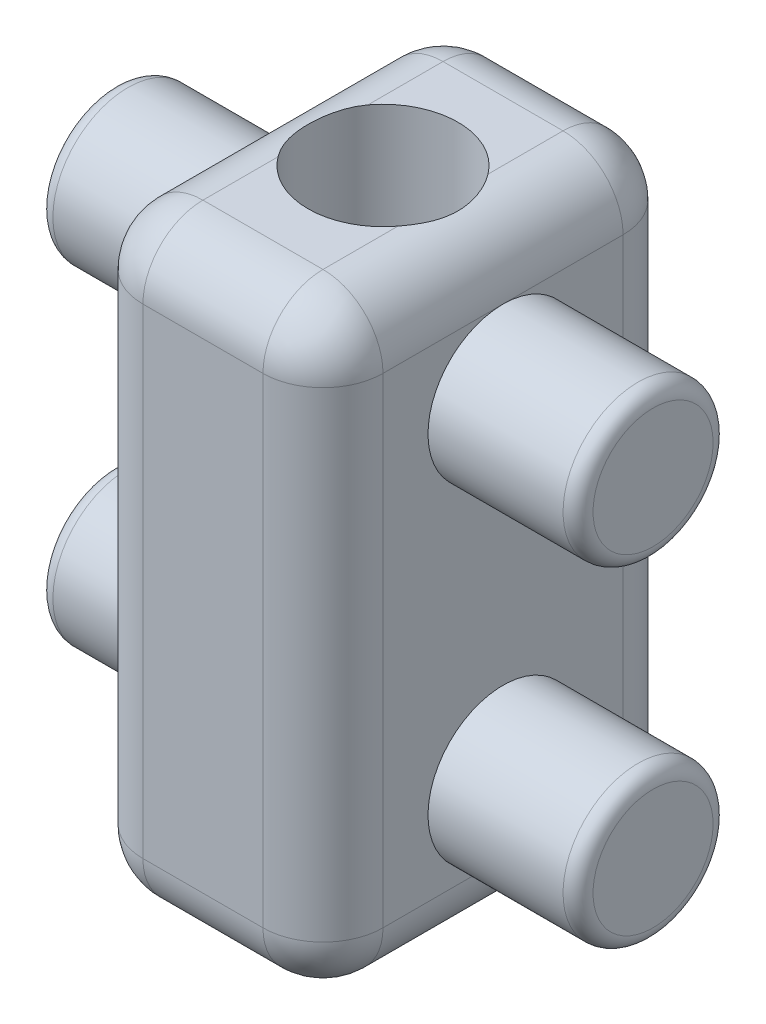
ISO-10303-21;
HEADER;
FILE_DESCRIPTION(('STEP AP214'),'2;1');
FILE_NAME('part.step','',(''),(''),'','','');
FILE_SCHEMA(('AUTOMOTIVE_DESIGN { 1 0 10303 214 1 1 1 1 }'));
ENDSEC;
DATA;
#1=APPLICATION_CONTEXT('core data for automotive mechanical design processes');
#2=APPLICATION_PROTOCOL_DEFINITION('international standard','automotive_design',2000,#1);
#3=PRODUCT_CONTEXT('',#1,'mechanical');
#4=PRODUCT('Part','Part','',(#3));
#5=PRODUCT_RELATED_PRODUCT_CATEGORY('part','',(#4));
#6=PRODUCT_DEFINITION_FORMATION('','',#4);
#7=PRODUCT_DEFINITION_CONTEXT('part definition',#1,'design');
#8=PRODUCT_DEFINITION('design','',#6,#7);
#9=PRODUCT_DEFINITION_SHAPE('','',#8);
#10=(LENGTH_UNIT() NAMED_UNIT(*) SI_UNIT(.MILLI.,.METRE.));
#11=(NAMED_UNIT(*) PLANE_ANGLE_UNIT() SI_UNIT($,.RADIAN.));
#12=(NAMED_UNIT(*) SI_UNIT($,.STERADIAN.) SOLID_ANGLE_UNIT());
#13=UNCERTAINTY_MEASURE_WITH_UNIT(LENGTH_MEASURE(1.E-05),#10,'distance_accuracy_value','');
#14=(GEOMETRIC_REPRESENTATION_CONTEXT(3) GLOBAL_UNCERTAINTY_ASSIGNED_CONTEXT((#13)) GLOBAL_UNIT_ASSIGNED_CONTEXT((#10,
#11,#12)) REPRESENTATION_CONTEXT('',''));
#15=CARTESIAN_POINT('',(0.,0.,0.));
#16=DIRECTION('',(0.,0.,1.));
#17=DIRECTION('',(1.,0.,0.));
#18=AXIS2_PLACEMENT_3D('',#15,#16,#17);
#19=CARTESIAN_POINT('',(-11.43,12.7,-12.7));
#20=DIRECTION('',(0.,-1.,0.));
#21=DIRECTION('',(0.,0.,-1.));
#22=AXIS2_PLACEMENT_3D('',#19,#20,#21);
#23=PLANE('',#22);
#24=DIRECTION('',(0.,0.,1.));
#25=VECTOR('',#24,1.);
#26=CARTESIAN_POINT('',(2.54,12.7,7.62));
#27=LINE('',#26,#25);
#28=CARTESIAN_POINT('',(2.54,12.7,5.08));
#29=VERTEX_POINT('',#28);
#30=CARTESIAN_POINT('',(2.54,12.7,1.905));
#31=VERTEX_POINT('',#30);
#32=EDGE_CURVE('E157',#29,#31,#27,.F.);
#33=ORIENTED_EDGE('',*,*,#32,.T.);
#34=CARTESIAN_POINT('',(0.,12.7,0.));
#35=DIRECTION('',(0.,-1.,0.));
#36=DIRECTION('',(0.,0.,-1.));
#37=AXIS2_PLACEMENT_3D('',#34,#35,#36);
#38=CIRCLE('',#37,3.175);
#39=CARTESIAN_POINT('',(-2.54,12.7,1.905));
#40=VERTEX_POINT('',#39);
#41=EDGE_CURVE('E11',#31,#40,#38,.T.);
#42=ORIENTED_EDGE('',*,*,#41,.T.);
#43=DIRECTION('',(0.,0.,1.));
#44=VECTOR('',#43,1.);
#45=CARTESIAN_POINT('',(-2.54,12.7,7.62));
#46=LINE('',#45,#44);
#47=CARTESIAN_POINT('',(-2.54,12.7,5.08));
#48=VERTEX_POINT('',#47);
#49=EDGE_CURVE('E173',#40,#48,#46,.T.);
#50=ORIENTED_EDGE('',*,*,#49,.T.);
#51=DIRECTION('',(-1.,0.,0.));
#52=VECTOR('',#51,1.);
#53=CARTESIAN_POINT('',(5.08,12.7,5.08));
#54=LINE('',#53,#52);
#55=EDGE_CURVE('E163',#48,#29,#54,.F.);
#56=ORIENTED_EDGE('',*,*,#55,.T.);
#57=EDGE_LOOP('',(#33,#42,#50,#56));
#58=FACE_BOUND('',#57,.T.);
#59=ADVANCED_FACE('F35',(#58),#23,.F.);
#60=CARTESIAN_POINT('',(5.08,0.,0.));
#61=DIRECTION('',(-1.,0.,0.));
#62=DIRECTION('',(0.,0.,1.));
#63=AXIS2_PLACEMENT_3D('',#60,#61,#62);
#64=PLANE('',#63);
#65=DIRECTION('',(0.,0.,-1.));
#66=VECTOR('',#65,1.);
#67=CARTESIAN_POINT('',(5.08,-10.16,0.));
#68=LINE('',#67,#66);
#69=CARTESIAN_POINT('',(5.08,-10.16,5.08));
#70=VERTEX_POINT('',#69);
#71=CARTESIAN_POINT('',(5.08,-10.16,0.));
#72=VERTEX_POINT('',#71);
#73=EDGE_CURVE('E203',#70,#72,#68,.T.);
#74=ORIENTED_EDGE('',*,*,#73,.T.);
#75=CARTESIAN_POINT('',(5.08,-6.985,0.));
#76=DIRECTION('',(1.,0.,0.));
#77=DIRECTION('',(0.,0.,-1.));
#78=AXIS2_PLACEMENT_3D('',#75,#76,#77);
#79=CIRCLE('',#78,3.175);
#80=EDGE_CURVE('E705',#72,#72,#79,.T.);
#81=ORIENTED_EDGE('',*,*,#80,.F.);
#82=CARTESIAN_POINT('',(5.08,-10.16,-5.08));
#83=VERTEX_POINT('',#82);
#84=EDGE_CURVE('E202',#72,#83,#68,.T.);
#85=ORIENTED_EDGE('',*,*,#84,.T.);
#86=DIRECTION('',(0.,1.,0.));
#87=VECTOR('',#86,1.);
#88=CARTESIAN_POINT('',(5.08,0.,-5.08));
#89=LINE('',#88,#87);
#90=CARTESIAN_POINT('',(5.08,10.16,-5.08));
#91=VERTEX_POINT('',#90);
#92=EDGE_CURVE('E196',#83,#91,#89,.T.);
#93=ORIENTED_EDGE('',*,*,#92,.T.);
#94=DIRECTION('',(0.,0.,1.));
#95=VECTOR('',#94,1.);
#96=CARTESIAN_POINT('',(5.08,10.16,0.));
#97=LINE('',#96,#95);
#98=CARTESIAN_POINT('',(5.08,10.16,0.));
#99=VERTEX_POINT('',#98);
#100=EDGE_CURVE('E199',#91,#99,#97,.T.);
#101=ORIENTED_EDGE('',*,*,#100,.T.);
#102=CARTESIAN_POINT('',(5.08,6.985,0.));
#103=DIRECTION('',(1.,0.,0.));
#104=DIRECTION('',(0.,0.,-1.));
#105=AXIS2_PLACEMENT_3D('',#102,#103,#104);
#106=CIRCLE('',#105,3.175);
#107=EDGE_CURVE('E209',#99,#99,#106,.T.);
#108=ORIENTED_EDGE('',*,*,#107,.F.);
#109=CARTESIAN_POINT('',(5.08,10.16,5.08));
#110=VERTEX_POINT('',#109);
#111=EDGE_CURVE('E198',#99,#110,#97,.T.);
#112=ORIENTED_EDGE('',*,*,#111,.T.);
#113=DIRECTION('',(0.,-1.,0.));
#114=VECTOR('',#113,1.);
#115=CARTESIAN_POINT('',(5.08,0.,5.08));
#116=LINE('',#115,#114);
#117=EDGE_CURVE('E58',#110,#70,#116,.T.);
#118=ORIENTED_EDGE('',*,*,#117,.T.);
#119=EDGE_LOOP('',(#74,#81,#85,#93,#101,#108,#112,#118));
#120=FACE_BOUND('',#119,.T.);
#121=ADVANCED_FACE('F365',(#120),#64,.F.);
#122=CARTESIAN_POINT('',(5.08,-12.7,-7.62));
#123=DIRECTION('',(0.,0.,1.));
#124=DIRECTION('',(1.,0.,0.));
#125=AXIS2_PLACEMENT_3D('',#122,#123,#124);
#126=PLANE('',#125);
#127=DIRECTION('',(-1.,0.,0.));
#128=VECTOR('',#127,1.);
#129=CARTESIAN_POINT('',(5.08,-10.16,-7.62));
#130=LINE('',#129,#128);
#131=CARTESIAN_POINT('',(2.54,-10.16,-7.62));
#132=VERTEX_POINT('',#131);
#133=CARTESIAN_POINT('',(-2.54,-10.16,-7.62));
#134=VERTEX_POINT('',#133);
#135=EDGE_CURVE('E715',#132,#134,#130,.T.);
#136=ORIENTED_EDGE('',*,*,#135,.T.);
#137=DIRECTION('',(0.,1.,0.));
#138=VECTOR('',#137,1.);
#139=CARTESIAN_POINT('',(-2.54,12.7,-7.62));
#140=LINE('',#139,#138);
#141=CARTESIAN_POINT('',(-2.54,10.16,-7.62));
#142=VERTEX_POINT('',#141);
#143=EDGE_CURVE('E718',#134,#142,#140,.T.);
#144=ORIENTED_EDGE('',*,*,#143,.T.);
#145=DIRECTION('',(-1.,0.,0.));
#146=VECTOR('',#145,1.);
#147=CARTESIAN_POINT('',(5.08,10.16,-7.62));
#148=LINE('',#147,#146);
#149=CARTESIAN_POINT('',(2.54,10.16,-7.62));
#150=VERTEX_POINT('',#149);
#151=EDGE_CURVE('E713',#142,#150,#148,.F.);
#152=ORIENTED_EDGE('',*,*,#151,.T.);
#153=DIRECTION('',(0.,1.,0.));
#154=VECTOR('',#153,1.);
#155=CARTESIAN_POINT('',(2.54,-12.7,-7.62));
#156=LINE('',#155,#154);
#157=EDGE_CURVE('E276',#150,#132,#156,.F.);
#158=ORIENTED_EDGE('',*,*,#157,.T.);
#159=EDGE_LOOP('',(#136,#144,#152,#158));
#160=FACE_BOUND('',#159,.T.);
#161=ADVANCED_FACE('F368',(#160),#126,.F.);
#162=CARTESIAN_POINT('',(5.08,-12.7,7.62));
#163=DIRECTION('',(0.,0.,-1.));
#164=DIRECTION('',(-1.,0.,0.));
#165=AXIS2_PLACEMENT_3D('',#162,#163,#164);
#166=PLANE('',#165);
#167=DIRECTION('',(-1.,0.,0.));
#168=VECTOR('',#167,1.);
#169=CARTESIAN_POINT('',(5.08,10.16,7.62));
#170=LINE('',#169,#168);
#171=CARTESIAN_POINT('',(2.54,10.16,7.62));
#172=VERTEX_POINT('',#171);
#173=CARTESIAN_POINT('',(-2.54,10.16,7.62));
#174=VERTEX_POINT('',#173);
#175=EDGE_CURVE('E181',#172,#174,#170,.T.);
#176=ORIENTED_EDGE('',*,*,#175,.T.);
#177=DIRECTION('',(0.,-1.,0.));
#178=VECTOR('',#177,1.);
#179=CARTESIAN_POINT('',(-2.54,-12.7,7.62));
#180=LINE('',#179,#178);
#181=CARTESIAN_POINT('',(-2.54,-10.16,7.62));
#182=VERTEX_POINT('',#181);
#183=EDGE_CURVE('E184',#174,#182,#180,.T.);
#184=ORIENTED_EDGE('',*,*,#183,.T.);
#185=DIRECTION('',(-1.,0.,0.));
#186=VECTOR('',#185,1.);
#187=CARTESIAN_POINT('',(5.08,-10.16,7.62));
#188=LINE('',#187,#186);
#189=CARTESIAN_POINT('',(2.54,-10.16,7.62));
#190=VERTEX_POINT('',#189);
#191=EDGE_CURVE('E179',#182,#190,#188,.F.);
#192=ORIENTED_EDGE('',*,*,#191,.T.);
#193=DIRECTION('',(0.,-1.,0.));
#194=VECTOR('',#193,1.);
#195=CARTESIAN_POINT('',(2.54,-12.7,7.62));
#196=LINE('',#195,#194);
#197=EDGE_CURVE('E177',#190,#172,#196,.F.);
#198=ORIENTED_EDGE('',*,*,#197,.T.);
#199=EDGE_LOOP('',(#176,#184,#192,#198));
#200=FACE_BOUND('',#199,.T.);
#201=ADVANCED_FACE('F377',(#200),#166,.F.);
#202=CARTESIAN_POINT('',(5.08,-12.7,7.62));
#203=DIRECTION('',(0.,1.,0.));
#204=DIRECTION('',(0.,0.,1.));
#205=AXIS2_PLACEMENT_3D('',#202,#203,#204);
#206=PLANE('',#205);
#207=DIRECTION('',(-1.,0.,0.));
#208=VECTOR('',#207,1.);
#209=CARTESIAN_POINT('',(5.08,-12.7,5.08));
#210=LINE('',#209,#208);
#211=CARTESIAN_POINT('',(2.54,-12.7,5.08));
#212=VERTEX_POINT('',#211);
#213=CARTESIAN_POINT('',(-2.54,-12.7,5.08));
#214=VERTEX_POINT('',#213);
#215=EDGE_CURVE('E722',#212,#214,#210,.T.);
#216=ORIENTED_EDGE('',*,*,#215,.T.);
#217=DIRECTION('',(0.,0.,-1.));
#218=VECTOR('',#217,1.);
#219=CARTESIAN_POINT('',(-2.54,-12.7,-7.62));
#220=LINE('',#219,#218);
#221=CARTESIAN_POINT('',(-2.54,-12.7,-5.08));
#222=VERTEX_POINT('',#221);
#223=EDGE_CURVE('E168',#214,#222,#220,.T.);
#224=ORIENTED_EDGE('',*,*,#223,.T.);
#225=DIRECTION('',(-1.,0.,0.));
#226=VECTOR('',#225,1.);
#227=CARTESIAN_POINT('',(5.08,-12.7,-5.08));
#228=LINE('',#227,#226);
#229=CARTESIAN_POINT('',(2.54,-12.7,-5.08));
#230=VERTEX_POINT('',#229);
#231=EDGE_CURVE('E723',#222,#230,#228,.F.);
#232=ORIENTED_EDGE('',*,*,#231,.T.);
#233=DIRECTION('',(0.,0.,-1.));
#234=VECTOR('',#233,1.);
#235=CARTESIAN_POINT('',(2.54,-12.7,7.62));
#236=LINE('',#235,#234);
#237=EDGE_CURVE('E720',#230,#212,#236,.F.);
#238=ORIENTED_EDGE('',*,*,#237,.T.);
#239=EDGE_LOOP('',(#216,#224,#232,#238));
#240=FACE_BOUND('',#239,.T.);
#241=ADVANCED_FACE('F373',(#240),#206,.F.);
#242=CARTESIAN_POINT('',(-5.08,0.,0.));
#243=DIRECTION('',(-1.,0.,0.));
#244=DIRECTION('',(0.,0.,1.));
#245=AXIS2_PLACEMENT_3D('',#242,#243,#244);
#246=PLANE('',#245);
#247=DIRECTION('',(0.,0.,-1.));
#248=VECTOR('',#247,1.);
#249=CARTESIAN_POINT('',(-5.08,-10.16,7.62));
#250=LINE('',#249,#248);
#251=CARTESIAN_POINT('',(-5.08,-10.16,-5.08));
#252=VERTEX_POINT('',#251);
#253=CARTESIAN_POINT('',(-5.08,-10.16,0.));
#254=VERTEX_POINT('',#253);
#255=EDGE_CURVE('E189',#252,#254,#250,.F.);
#256=ORIENTED_EDGE('',*,*,#255,.T.);
#257=CARTESIAN_POINT('',(-5.08,-6.985,0.));
#258=DIRECTION('',(1.,0.,0.));
#259=DIRECTION('',(0.,0.,-1.));
#260=AXIS2_PLACEMENT_3D('',#257,#258,#259);
#261=CIRCLE('',#260,3.175);
#262=EDGE_CURVE('E160',#254,#254,#261,.T.);
#263=ORIENTED_EDGE('',*,*,#262,.T.);
#264=CARTESIAN_POINT('',(-5.08,-10.16,5.08));
#265=VERTEX_POINT('',#264);
#266=EDGE_CURVE('E188',#254,#265,#250,.F.);
#267=ORIENTED_EDGE('',*,*,#266,.T.);
#268=DIRECTION('',(0.,-1.,0.));
#269=VECTOR('',#268,1.);
#270=CARTESIAN_POINT('',(-5.08,12.7,5.08));
#271=LINE('',#270,#269);
#272=CARTESIAN_POINT('',(-5.08,10.16,5.08));
#273=VERTEX_POINT('',#272);
#274=EDGE_CURVE('E191',#265,#273,#271,.F.);
#275=ORIENTED_EDGE('',*,*,#274,.T.);
#276=DIRECTION('',(0.,0.,1.));
#277=VECTOR('',#276,1.);
#278=CARTESIAN_POINT('',(-5.08,10.16,-7.62));
#279=LINE('',#278,#277);
#280=CARTESIAN_POINT('',(-5.08,10.16,0.));
#281=VERTEX_POINT('',#280);
#282=EDGE_CURVE('E194',#273,#281,#279,.F.);
#283=ORIENTED_EDGE('',*,*,#282,.T.);
#284=CARTESIAN_POINT('',(-5.08,6.985,0.));
#285=DIRECTION('',(1.,0.,0.));
#286=DIRECTION('',(0.,0.,-1.));
#287=AXIS2_PLACEMENT_3D('',#284,#285,#286);
#288=CIRCLE('',#287,3.175);
#289=EDGE_CURVE('E708',#281,#281,#288,.T.);
#290=ORIENTED_EDGE('',*,*,#289,.T.);
#291=CARTESIAN_POINT('',(-5.08,10.16,-5.08));
#292=VERTEX_POINT('',#291);
#293=EDGE_CURVE('E193',#281,#292,#279,.F.);
#294=ORIENTED_EDGE('',*,*,#293,.T.);
#295=DIRECTION('',(0.,1.,0.));
#296=VECTOR('',#295,1.);
#297=CARTESIAN_POINT('',(-5.08,-12.7,-5.08));
#298=LINE('',#297,#296);
#299=EDGE_CURVE('E186',#292,#252,#298,.F.);
#300=ORIENTED_EDGE('',*,*,#299,.T.);
#301=EDGE_LOOP('',(#256,#263,#267,#275,#283,#290,#294,#300));
#302=FACE_BOUND('',#301,.T.);
#303=ADVANCED_FACE('F369',(#302),#246,.T.);
#304=CARTESIAN_POINT('',(5.08,10.16,5.08));
#305=DIRECTION('',(-1.,0.,0.));
#306=DIRECTION('',(0.,0.,1.));
#307=AXIS2_PLACEMENT_3D('',#304,#305,#306);
#308=CYLINDRICAL_SURFACE('',#307,2.54);
#309=CARTESIAN_POINT('',(2.54,10.16,5.08));
#310=DIRECTION('',(1.,0.,0.));
#311=DIRECTION('',(0.,0.,-1.));
#312=AXIS2_PLACEMENT_3D('',#309,#310,#311);
#313=CIRCLE('',#312,2.54);
#314=EDGE_CURVE('E273',#29,#172,#313,.T.);
#315=ORIENTED_EDGE('',*,*,#314,.F.);
#316=ORIENTED_EDGE('',*,*,#55,.F.);
#317=CARTESIAN_POINT('',(-2.54,10.16,5.08));
#318=DIRECTION('',(-1.,0.,0.));
#319=DIRECTION('',(0.,0.,1.));
#320=AXIS2_PLACEMENT_3D('',#317,#318,#319);
#321=CIRCLE('',#320,2.54);
#322=EDGE_CURVE('E270',#174,#48,#321,.T.);
#323=ORIENTED_EDGE('',*,*,#322,.F.);
#324=ORIENTED_EDGE('',*,*,#175,.F.);
#325=EDGE_LOOP('',(#315,#316,#323,#324));
#326=FACE_BOUND('',#325,.T.);
#327=ADVANCED_FACE('F372',(#326),#308,.T.);
#328=CARTESIAN_POINT('',(2.54,10.16,5.08));
#329=DIRECTION('',(0.,0.,1.));
#330=DIRECTION('',(1.,0.,0.));
#331=AXIS2_PLACEMENT_3D('',#328,#329,#330);
#332=SPHERICAL_SURFACE('',#331,2.54);
#333=CARTESIAN_POINT('',(2.54,10.16,5.08));
#334=DIRECTION('',(0.,0.,1.));
#335=DIRECTION('',(1.,0.,0.));
#336=AXIS2_PLACEMENT_3D('',#333,#334,#335);
#337=CIRCLE('',#336,2.54);
#338=EDGE_CURVE('E265',#29,#110,#337,.F.);
#339=ORIENTED_EDGE('',*,*,#338,.F.);
#340=ORIENTED_EDGE('',*,*,#314,.T.);
#341=CARTESIAN_POINT('',(2.54,10.16,5.08));
#342=DIRECTION('',(0.,1.,0.));
#343=DIRECTION('',(0.,0.,1.));
#344=AXIS2_PLACEMENT_3D('',#341,#342,#343);
#345=CIRCLE('',#344,2.54);
#346=EDGE_CURVE('E267',#110,#172,#345,.F.);
#347=ORIENTED_EDGE('',*,*,#346,.F.);
#348=EDGE_LOOP('',(#339,#340,#347));
#349=FACE_BOUND('',#348,.T.);
#350=ADVANCED_FACE('F648',(#349),#332,.T.);
#351=CARTESIAN_POINT('',(-2.54,10.16,5.08));
#352=DIRECTION('',(0.,0.,1.));
#353=DIRECTION('',(1.,0.,0.));
#354=AXIS2_PLACEMENT_3D('',#351,#352,#353);
#355=SPHERICAL_SURFACE('',#354,2.54);
#356=CARTESIAN_POINT('',(-2.54,10.16,5.08));
#357=DIRECTION('',(0.,1.,0.));
#358=DIRECTION('',(0.,0.,1.));
#359=AXIS2_PLACEMENT_3D('',#356,#357,#358);
#360=CIRCLE('',#359,2.54);
#361=EDGE_CURVE('E259',#174,#273,#360,.F.);
#362=ORIENTED_EDGE('',*,*,#361,.F.);
#363=ORIENTED_EDGE('',*,*,#322,.T.);
#364=CARTESIAN_POINT('',(-2.54,10.16,5.08));
#365=DIRECTION('',(0.,0.,1.));
#366=DIRECTION('',(1.,0.,0.));
#367=AXIS2_PLACEMENT_3D('',#364,#365,#366);
#368=CIRCLE('',#367,2.54);
#369=EDGE_CURVE('E262',#273,#48,#368,.F.);
#370=ORIENTED_EDGE('',*,*,#369,.F.);
#371=EDGE_LOOP('',(#362,#363,#370));
#372=FACE_BOUND('',#371,.T.);
#373=ADVANCED_FACE('F638',(#372),#355,.T.);
#374=CARTESIAN_POINT('',(2.54,0.,5.08));
#375=DIRECTION('',(0.,-1.,0.));
#376=DIRECTION('',(0.,0.,-1.));
#377=AXIS2_PLACEMENT_3D('',#374,#375,#376);
#378=CYLINDRICAL_SURFACE('',#377,2.54);
#379=ORIENTED_EDGE('',*,*,#346,.T.);
#380=ORIENTED_EDGE('',*,*,#197,.F.);
#381=CARTESIAN_POINT('',(2.54,-10.16,5.08));
#382=DIRECTION('',(0.,-1.,0.));
#383=DIRECTION('',(0.,0.,-1.));
#384=AXIS2_PLACEMENT_3D('',#381,#382,#383);
#385=CIRCLE('',#384,2.54);
#386=EDGE_CURVE('E253',#70,#190,#385,.T.);
#387=ORIENTED_EDGE('',*,*,#386,.F.);
#388=ORIENTED_EDGE('',*,*,#117,.F.);
#389=EDGE_LOOP('',(#379,#380,#387,#388));
#390=FACE_BOUND('',#389,.T.);
#391=ADVANCED_FACE('F632',(#390),#378,.T.);
#392=CARTESIAN_POINT('',(2.54,10.16,0.));
#393=DIRECTION('',(0.,0.,1.));
#394=DIRECTION('',(1.,0.,0.));
#395=AXIS2_PLACEMENT_3D('',#392,#393,#394);
#396=CYLINDRICAL_SURFACE('',#395,2.54);
#397=CARTESIAN_POINT('',(2.54,12.7,1.905));
#398=CARTESIAN_POINT('',(2.5930144747761,12.6999862252163,1.83433008024039));
#399=CARTESIAN_POINT('',(2.64304418780027,12.6983400949674,1.76146316158012));
#400=CARTESIAN_POINT('',(2.73681256754995,12.6928023717573,1.61190923242004));
#401=CARTESIAN_POINT('',(2.78055403974719,12.6889117840593,1.5352239461572));
#402=CARTESIAN_POINT('',(2.86150406932594,12.6798990340502,1.37848165114559));
#403=CARTESIAN_POINT('',(2.89870748689939,12.6747759102249,1.29842205047689));
#404=CARTESIAN_POINT('',(2.96631988606513,12.6642012790137,1.13549535037719));
#405=CARTESIAN_POINT('',(2.99672819686997,12.6587497392752,1.05262797470223));
#406=CARTESIAN_POINT('',(3.05054069604224,12.6483126113036,0.88464818978456));
#407=CARTESIAN_POINT('',(3.0739470624711,12.6433268785069,0.799536487656744));
#408=CARTESIAN_POINT('',(3.1136022125579,12.6344684587865,0.627605400580466));
#409=CARTESIAN_POINT('',(3.12985126443965,12.6305957301544,0.540786079753235));
#410=CARTESIAN_POINT('',(3.15504934782979,12.624443734051,0.366145178129403));
#411=CARTESIAN_POINT('',(3.16400731259552,12.6221625171033,0.278324957914515));
#412=CARTESIAN_POINT('',(3.17458002225839,12.6194589557401,0.102214919682188));
#413=CARTESIAN_POINT('',(3.17619487430703,12.6190365842002,0.0139251085358922));
#414=CARTESIAN_POINT('',(3.17208089299991,12.6200971385345,-0.161895069374409));
#415=CARTESIAN_POINT('',(3.16639983447211,12.6215676695157,-0.249426636477158));
#416=CARTESIAN_POINT('',(3.14782483185976,12.6262198130967,-0.423675780026822));
#417=CARTESIAN_POINT('',(3.13493069870951,12.6294014705478,-0.510393335076655));
#418=CARTESIAN_POINT('',(3.10201816982114,12.6370992435227,-0.682489232509958));
#419=CARTESIAN_POINT('',(3.08199288994507,12.6416166478083,-0.767866197293173));
#420=CARTESIAN_POINT('',(3.03496640143451,12.6514222048976,-0.936630510721468));
#421=CARTESIAN_POINT('',(3.00796532716197,12.6567103428551,-1.02001789765435));
#422=CARTESIAN_POINT('',(2.95102683913863,12.6666673723006,-1.17384523842122));
#423=CARTESIAN_POINT('',(2.92189644299456,12.6713297189628,-1.24458573482167));
#424=CARTESIAN_POINT('',(2.85859769024736,12.68014203093,-1.3837954353501));
#425=CARTESIAN_POINT('',(2.82443031366766,12.6842920956194,-1.45226507814085));
#426=CARTESIAN_POINT('',(2.75126299343156,12.6914658240478,-1.58650838612093));
#427=CARTESIAN_POINT('',(2.71227019344552,12.6944911269402,-1.65228584922509));
#428=CARTESIAN_POINT('',(2.62959767281221,12.6987548964392,-1.78092659831066));
#429=CARTESIAN_POINT('',(2.5859157945231,12.6999925366479,-1.84378852351398));
#430=CARTESIAN_POINT('',(2.54,12.7,-1.905));
#431=B_SPLINE_CURVE_WITH_KNOTS('',3,(#397,#398,#399,#400,#401,#402,#403,#404,#405,#406,#407,
#408,#409,#410,#411,#412,#413,#414,#415,#416,#417,#418,#419,#420,#421,#422,#423,#424,#425,#426,
#427,#428,#429,#430),.UNSPECIFIED.,.F.,.F.,(4,2,2,2,2,2,2,2,2,2,2,2,2,2,2,2,4),(0.,
0.26489527949035,0.529672007856606,0.794655964885841,1.05966606859315,1.32459365094662,
1.58951130416678,1.85410388168812,2.1186925982337,2.38155754601834,2.64442938421755,
2.90755567990787,3.17067690785609,3.40041930587477,3.63011706276295,3.85947874883193,
4.08894642994839),.UNSPECIFIED.);
#432=CARTESIAN_POINT('',(2.54,12.7,-1.905));
#433=VERTEX_POINT('',#432);
#434=EDGE_CURVE('E50',#31,#433,#431,.T.);
#435=ORIENTED_EDGE('',*,*,#434,.F.);
#436=ORIENTED_EDGE('',*,*,#32,.F.);
#437=ORIENTED_EDGE('',*,*,#338,.T.);
#438=ORIENTED_EDGE('',*,*,#111,.F.);
#439=ORIENTED_EDGE('',*,*,#100,.F.);
#440=CARTESIAN_POINT('',(2.54,10.16,-5.08));
#441=DIRECTION('',(0.,0.,-1.));
#442=DIRECTION('',(-1.,0.,0.));
#443=AXIS2_PLACEMENT_3D('',#440,#441,#442);
#444=CIRCLE('',#443,2.54);
#445=CARTESIAN_POINT('',(2.54,12.7,-5.08));
#446=VERTEX_POINT('',#445);
#447=EDGE_CURVE('E250',#446,#91,#444,.T.);
#448=ORIENTED_EDGE('',*,*,#447,.F.);
#449=EDGE_CURVE('E159',#433,#446,#27,.F.);
#450=ORIENTED_EDGE('',*,*,#449,.F.);
#451=EDGE_LOOP('',(#435,#436,#437,#438,#439,#448,#450));
#452=FACE_BOUND('',#451,.T.);
#453=ADVANCED_FACE('F155',(#452),#396,.T.);
#454=CARTESIAN_POINT('',(5.08,10.16,-5.08));
#455=DIRECTION('',(-1.,0.,0.));
#456=DIRECTION('',(0.,0.,1.));
#457=AXIS2_PLACEMENT_3D('',#454,#455,#456);
#458=CYLINDRICAL_SURFACE('',#457,2.54);
#459=CARTESIAN_POINT('',(-2.54,10.16,-5.08));
#460=DIRECTION('',(-1.,0.,0.));
#461=DIRECTION('',(0.,0.,1.));
#462=AXIS2_PLACEMENT_3D('',#459,#460,#461);
#463=CIRCLE('',#462,2.54);
#464=CARTESIAN_POINT('',(-2.54,12.7,-5.08));
#465=VERTEX_POINT('',#464);
#466=EDGE_CURVE('E244',#465,#142,#463,.T.);
#467=ORIENTED_EDGE('',*,*,#466,.F.);
#468=DIRECTION('',(-1.,0.,0.));
#469=VECTOR('',#468,1.);
#470=CARTESIAN_POINT('',(5.08,12.7,-5.08));
#471=LINE('',#470,#469);
#472=EDGE_CURVE('E166',#446,#465,#471,.T.);
#473=ORIENTED_EDGE('',*,*,#472,.F.);
#474=CARTESIAN_POINT('',(2.54,10.16,-5.08));
#475=DIRECTION('',(1.,0.,0.));
#476=DIRECTION('',(0.,0.,-1.));
#477=AXIS2_PLACEMENT_3D('',#474,#475,#476);
#478=CIRCLE('',#477,2.54);
#479=EDGE_CURVE('E247',#150,#446,#478,.T.);
#480=ORIENTED_EDGE('',*,*,#479,.F.);
#481=ORIENTED_EDGE('',*,*,#151,.F.);
#482=EDGE_LOOP('',(#467,#473,#480,#481));
#483=FACE_BOUND('',#482,.T.);
#484=ADVANCED_FACE('F438',(#483),#458,.T.);
#485=CARTESIAN_POINT('',(-2.54,10.16,7.62));
#486=DIRECTION('',(0.,0.,-1.));
#487=DIRECTION('',(-1.,0.,0.));
#488=AXIS2_PLACEMENT_3D('',#485,#486,#487);
#489=CYLINDRICAL_SURFACE('',#488,2.54);
#490=CARTESIAN_POINT('',(-2.54,12.7,-1.905));
#491=CARTESIAN_POINT('',(-2.5930144747761,12.6999862252163,-1.83433008024039));
#492=CARTESIAN_POINT('',(-2.64304418780027,12.6983400949674,-1.76146316158012));
#493=CARTESIAN_POINT('',(-2.73681256754995,12.6928023717573,-1.61190923242004));
#494=CARTESIAN_POINT('',(-2.78055403974719,12.6889117840593,-1.53522394615721));
#495=CARTESIAN_POINT('',(-2.86150406932594,12.6798990340502,-1.37848165114559));
#496=CARTESIAN_POINT('',(-2.89870748689939,12.6747759102249,-1.29842205047689));
#497=CARTESIAN_POINT('',(-2.96631988606513,12.6642012790137,-1.13549535037719));
#498=CARTESIAN_POINT('',(-2.99672819686997,12.6587497392752,-1.05262797470223));
#499=CARTESIAN_POINT('',(-3.05054069604224,12.6483126113036,-0.884648189784562));
#500=CARTESIAN_POINT('',(-3.0739470624711,12.6433268785069,-0.799536487656746));
#501=CARTESIAN_POINT('',(-3.1136022125579,12.6344684587865,-0.627605400580467));
#502=CARTESIAN_POINT('',(-3.12985126443965,12.6305957301544,-0.540786079753237));
#503=CARTESIAN_POINT('',(-3.15504934782979,12.624443734051,-0.366145178129405));
#504=CARTESIAN_POINT('',(-3.16400731259552,12.6221625171033,-0.278324957914517));
#505=CARTESIAN_POINT('',(-3.17458002225839,12.6194589557401,-0.10221491968219));
#506=CARTESIAN_POINT('',(-3.17619487430703,12.6190365842002,-0.0139251085358941));
#507=CARTESIAN_POINT('',(-3.17208089299991,12.6200971385345,0.161895069374407));
#508=CARTESIAN_POINT('',(-3.16639983447211,12.6215676695157,0.249426636477156));
#509=CARTESIAN_POINT('',(-3.14782483185976,12.6262198130967,0.42367578002682));
#510=CARTESIAN_POINT('',(-3.13493069870951,12.6294014705478,0.510393335076653));
#511=CARTESIAN_POINT('',(-3.10201816982114,12.6370992435227,0.682489232509956));
#512=CARTESIAN_POINT('',(-3.08199288994507,12.6416166478083,0.767866197293171));
#513=CARTESIAN_POINT('',(-3.03496640143451,12.6514222048976,0.936630510721466));
#514=CARTESIAN_POINT('',(-3.00796532716197,12.6567103428551,1.02001789765435));
#515=CARTESIAN_POINT('',(-2.95102683913863,12.6666673723006,1.17384523842122));
#516=CARTESIAN_POINT('',(-2.92189644299456,12.6713297189628,1.24458573482167));
#517=CARTESIAN_POINT('',(-2.85859769024736,12.68014203093,1.3837954353501));
#518=CARTESIAN_POINT('',(-2.82443031366766,12.6842920956194,1.45226507814085));
#519=CARTESIAN_POINT('',(-2.75126299343156,12.6914658240478,1.58650838612093));
#520=CARTESIAN_POINT('',(-2.71227019344552,12.6944911269402,1.65228584922509));
#521=CARTESIAN_POINT('',(-2.62959767281221,12.6987548964392,1.78092659831066));
#522=CARTESIAN_POINT('',(-2.5859157945231,12.6999925366479,1.84378852351398));
#523=CARTESIAN_POINT('',(-2.54,12.7,1.905));
#524=B_SPLINE_CURVE_WITH_KNOTS('',3,(#490,#491,#492,#493,#494,#495,#496,#497,#498,#499,#500,
#501,#502,#503,#504,#505,#506,#507,#508,#509,#510,#511,#512,#513,#514,#515,#516,#517,#518,#519,
#520,#521,#522,#523),.UNSPECIFIED.,.F.,.F.,(4,2,2,2,2,2,2,2,2,2,2,2,2,2,2,2,4),(0.,
0.26489527949035,0.529672007856606,0.794655964885841,1.05966606859315,1.32459365094662,
1.58951130416678,1.85410388168812,2.1186925982337,2.38155754601833,2.64442938421755,
2.90755567990787,3.17067690785609,3.40041930587477,3.63011706276295,3.85947874883193,
4.08894642994839),.UNSPECIFIED.);
#525=CARTESIAN_POINT('',(-2.54,12.7,-1.905));
#526=VERTEX_POINT('',#525);
#527=EDGE_CURVE('E148',#526,#40,#524,.T.);
#528=ORIENTED_EDGE('',*,*,#527,.F.);
#529=EDGE_CURVE('E174',#465,#526,#46,.T.);
#530=ORIENTED_EDGE('',*,*,#529,.F.);
#531=CARTESIAN_POINT('',(-2.54,10.16,-5.08));
#532=DIRECTION('',(0.,0.,-1.));
#533=DIRECTION('',(0.,1.,0.));
#534=AXIS2_PLACEMENT_3D('',#531,#532,#533);
#535=CIRCLE('',#534,2.54);
#536=EDGE_CURVE('E241',#292,#465,#535,.T.);
#537=ORIENTED_EDGE('',*,*,#536,.F.);
#538=ORIENTED_EDGE('',*,*,#293,.F.);
#539=ORIENTED_EDGE('',*,*,#282,.F.);
#540=ORIENTED_EDGE('',*,*,#369,.T.);
#541=ORIENTED_EDGE('',*,*,#49,.F.);
#542=EDGE_LOOP('',(#528,#530,#537,#538,#539,#540,#541));
#543=FACE_BOUND('',#542,.T.);
#544=ADVANCED_FACE('F305',(#543),#489,.T.);
#545=CARTESIAN_POINT('',(-2.54,-12.7,5.08));
#546=DIRECTION('',(0.,1.,0.));
#547=DIRECTION('',(0.,0.,1.));
#548=AXIS2_PLACEMENT_3D('',#545,#546,#547);
#549=CYLINDRICAL_SURFACE('',#548,2.54);
#550=ORIENTED_EDGE('',*,*,#361,.T.);
#551=ORIENTED_EDGE('',*,*,#274,.F.);
#552=CARTESIAN_POINT('',(-2.54,-10.16,5.08));
#553=DIRECTION('',(0.,-1.,0.));
#554=DIRECTION('',(0.,0.,-1.));
#555=AXIS2_PLACEMENT_3D('',#552,#553,#554);
#556=CIRCLE('',#555,2.54);
#557=EDGE_CURVE('E238',#182,#265,#556,.T.);
#558=ORIENTED_EDGE('',*,*,#557,.F.);
#559=ORIENTED_EDGE('',*,*,#183,.F.);
#560=EDGE_LOOP('',(#550,#551,#558,#559));
#561=FACE_BOUND('',#560,.T.);
#562=ADVANCED_FACE('F430',(#561),#549,.T.);
#563=CARTESIAN_POINT('',(5.08,-10.16,5.08));
#564=DIRECTION('',(-1.,0.,0.));
#565=DIRECTION('',(0.,0.,1.));
#566=AXIS2_PLACEMENT_3D('',#563,#564,#565);
#567=CYLINDRICAL_SURFACE('',#566,2.54);
#568=CARTESIAN_POINT('',(2.54,-10.16,5.08));
#569=DIRECTION('',(1.,0.,0.));
#570=DIRECTION('',(0.,0.,-1.));
#571=AXIS2_PLACEMENT_3D('',#568,#569,#570);
#572=CIRCLE('',#571,2.54);
#573=EDGE_CURVE('E256',#190,#212,#572,.T.);
#574=ORIENTED_EDGE('',*,*,#573,.F.);
#575=ORIENTED_EDGE('',*,*,#191,.F.);
#576=CARTESIAN_POINT('',(-2.54,-10.16,5.08));
#577=DIRECTION('',(-1.,0.,0.));
#578=DIRECTION('',(0.,0.,1.));
#579=AXIS2_PLACEMENT_3D('',#576,#577,#578);
#580=CIRCLE('',#579,2.54);
#581=EDGE_CURVE('E235',#214,#182,#580,.T.);
#582=ORIENTED_EDGE('',*,*,#581,.F.);
#583=ORIENTED_EDGE('',*,*,#215,.F.);
#584=EDGE_LOOP('',(#574,#575,#582,#583));
#585=FACE_BOUND('',#584,.T.);
#586=ADVANCED_FACE('F427',(#585),#567,.T.);
#587=CARTESIAN_POINT('',(2.54,-10.16,5.08));
#588=DIRECTION('',(0.,0.,1.));
#589=DIRECTION('',(1.,0.,0.));
#590=AXIS2_PLACEMENT_3D('',#587,#588,#589);
#591=SPHERICAL_SURFACE('',#590,2.54);
#592=ORIENTED_EDGE('',*,*,#386,.T.);
#593=ORIENTED_EDGE('',*,*,#573,.T.);
#594=CARTESIAN_POINT('',(2.54,-10.16,5.08));
#595=DIRECTION('',(0.,0.,1.));
#596=DIRECTION('',(1.,0.,0.));
#597=AXIS2_PLACEMENT_3D('',#594,#595,#596);
#598=CIRCLE('',#597,2.54);
#599=EDGE_CURVE('E232',#70,#212,#598,.F.);
#600=ORIENTED_EDGE('',*,*,#599,.F.);
#601=EDGE_LOOP('',(#592,#593,#600));
#602=FACE_BOUND('',#601,.T.);
#603=ADVANCED_FACE('F423',(#602),#591,.T.);
#604=CARTESIAN_POINT('',(2.54,10.16,-5.08));
#605=DIRECTION('',(0.,0.,1.));
#606=DIRECTION('',(1.,0.,0.));
#607=AXIS2_PLACEMENT_3D('',#604,#605,#606);
#608=SPHERICAL_SURFACE('',#607,2.54);
#609=ORIENTED_EDGE('',*,*,#479,.T.);
#610=ORIENTED_EDGE('',*,*,#447,.T.);
#611=CARTESIAN_POINT('',(2.54,10.16,-5.08));
#612=DIRECTION('',(0.,1.,0.));
#613=DIRECTION('',(0.,0.,1.));
#614=AXIS2_PLACEMENT_3D('',#611,#612,#613);
#615=CIRCLE('',#614,2.54);
#616=EDGE_CURVE('E229',#150,#91,#615,.F.);
#617=ORIENTED_EDGE('',*,*,#616,.F.);
#618=EDGE_LOOP('',(#609,#610,#617));
#619=FACE_BOUND('',#618,.T.);
#620=ADVANCED_FACE('F419',(#619),#608,.T.);
#621=CARTESIAN_POINT('',(-2.54,10.16,-5.08));
#622=DIRECTION('',(0.,0.,1.));
#623=DIRECTION('',(1.,0.,0.));
#624=AXIS2_PLACEMENT_3D('',#621,#622,#623);
#625=SPHERICAL_SURFACE('',#624,2.54);
#626=ORIENTED_EDGE('',*,*,#536,.T.);
#627=ORIENTED_EDGE('',*,*,#466,.T.);
#628=CARTESIAN_POINT('',(-2.54,10.16,-5.08));
#629=DIRECTION('',(0.,1.,0.));
#630=DIRECTION('',(0.,0.,1.));
#631=AXIS2_PLACEMENT_3D('',#628,#629,#630);
#632=CIRCLE('',#631,2.54);
#633=EDGE_CURVE('E226',#292,#142,#632,.F.);
#634=ORIENTED_EDGE('',*,*,#633,.F.);
#635=EDGE_LOOP('',(#626,#627,#634));
#636=FACE_BOUND('',#635,.T.);
#637=ADVANCED_FACE('F415',(#636),#625,.T.);
#638=CARTESIAN_POINT('',(-2.54,-10.16,5.08));
#639=DIRECTION('',(0.,0.,1.));
#640=DIRECTION('',(1.,0.,0.));
#641=AXIS2_PLACEMENT_3D('',#638,#639,#640);
#642=SPHERICAL_SURFACE('',#641,2.54);
#643=ORIENTED_EDGE('',*,*,#581,.T.);
#644=ORIENTED_EDGE('',*,*,#557,.T.);
#645=CARTESIAN_POINT('',(-2.54,-10.16,5.08));
#646=DIRECTION('',(0.,0.,1.));
#647=DIRECTION('',(1.,0.,0.));
#648=AXIS2_PLACEMENT_3D('',#645,#646,#647);
#649=CIRCLE('',#648,2.54);
#650=EDGE_CURVE('E223',#214,#265,#649,.F.);
#651=ORIENTED_EDGE('',*,*,#650,.F.);
#652=EDGE_LOOP('',(#643,#644,#651));
#653=FACE_BOUND('',#652,.T.);
#654=ADVANCED_FACE('F411',(#653),#642,.T.);
#655=CARTESIAN_POINT('',(2.54,-10.16,0.));
#656=DIRECTION('',(0.,0.,-1.));
#657=DIRECTION('',(-1.,0.,0.));
#658=AXIS2_PLACEMENT_3D('',#655,#656,#657);
#659=CYLINDRICAL_SURFACE('',#658,2.54);
#660=ORIENTED_EDGE('',*,*,#599,.T.);
#661=ORIENTED_EDGE('',*,*,#237,.F.);
#662=CARTESIAN_POINT('',(2.54,-10.16,-5.08));
#663=DIRECTION('',(0.,0.,-1.));
#664=DIRECTION('',(-1.,0.,0.));
#665=AXIS2_PLACEMENT_3D('',#662,#663,#664);
#666=CIRCLE('',#665,2.54);
#667=EDGE_CURVE('E220',#83,#230,#666,.T.);
#668=ORIENTED_EDGE('',*,*,#667,.F.);
#669=ORIENTED_EDGE('',*,*,#84,.F.);
#670=ORIENTED_EDGE('',*,*,#73,.F.);
#671=EDGE_LOOP('',(#660,#661,#668,#669,#670));
#672=FACE_BOUND('',#671,.T.);
#673=ADVANCED_FACE('F407',(#672),#659,.T.);
#674=CARTESIAN_POINT('',(2.54,0.,-5.08));
#675=DIRECTION('',(0.,1.,0.));
#676=DIRECTION('',(0.,0.,1.));
#677=AXIS2_PLACEMENT_3D('',#674,#675,#676);
#678=CYLINDRICAL_SURFACE('',#677,2.54);
#679=ORIENTED_EDGE('',*,*,#616,.T.);
#680=ORIENTED_EDGE('',*,*,#92,.F.);
#681=CARTESIAN_POINT('',(2.54,-10.16,-5.08));
#682=DIRECTION('',(0.,-1.,0.));
#683=DIRECTION('',(0.,0.,-1.));
#684=AXIS2_PLACEMENT_3D('',#681,#682,#683);
#685=CIRCLE('',#684,2.54);
#686=EDGE_CURVE('E217',#132,#83,#685,.T.);
#687=ORIENTED_EDGE('',*,*,#686,.F.);
#688=ORIENTED_EDGE('',*,*,#157,.F.);
#689=EDGE_LOOP('',(#679,#680,#687,#688));
#690=FACE_BOUND('',#689,.T.);
#691=ADVANCED_FACE('F403',(#690),#678,.T.);
#692=CARTESIAN_POINT('',(-2.54,-12.7,-5.08));
#693=DIRECTION('',(0.,-1.,0.));
#694=DIRECTION('',(0.,0.,-1.));
#695=AXIS2_PLACEMENT_3D('',#692,#693,#694);
#696=CYLINDRICAL_SURFACE('',#695,2.54);
#697=ORIENTED_EDGE('',*,*,#633,.T.);
#698=ORIENTED_EDGE('',*,*,#143,.F.);
#699=CARTESIAN_POINT('',(-2.54,-10.16,-5.08));
#700=DIRECTION('',(0.,-1.,0.));
#701=DIRECTION('',(0.,0.,-1.));
#702=AXIS2_PLACEMENT_3D('',#699,#700,#701);
#703=CIRCLE('',#702,2.54);
#704=EDGE_CURVE('E214',#252,#134,#703,.T.);
#705=ORIENTED_EDGE('',*,*,#704,.F.);
#706=ORIENTED_EDGE('',*,*,#299,.F.);
#707=EDGE_LOOP('',(#697,#698,#705,#706));
#708=FACE_BOUND('',#707,.T.);
#709=ADVANCED_FACE('F399',(#708),#696,.T.);
#710=CARTESIAN_POINT('',(-2.54,-10.16,7.62));
#711=DIRECTION('',(0.,0.,1.));
#712=DIRECTION('',(1.,0.,0.));
#713=AXIS2_PLACEMENT_3D('',#710,#711,#712);
#714=CYLINDRICAL_SURFACE('',#713,2.54);
#715=ORIENTED_EDGE('',*,*,#650,.T.);
#716=ORIENTED_EDGE('',*,*,#266,.F.);
#717=ORIENTED_EDGE('',*,*,#255,.F.);
#718=CARTESIAN_POINT('',(-2.54,-10.16,-5.08));
#719=DIRECTION('',(0.,0.,-1.));
#720=DIRECTION('',(-1.,0.,0.));
#721=AXIS2_PLACEMENT_3D('',#718,#719,#720);
#722=CIRCLE('',#721,2.54);
#723=EDGE_CURVE('E211',#222,#252,#722,.T.);
#724=ORIENTED_EDGE('',*,*,#723,.F.);
#725=ORIENTED_EDGE('',*,*,#223,.F.);
#726=EDGE_LOOP('',(#715,#716,#717,#724,#725));
#727=FACE_BOUND('',#726,.T.);
#728=ADVANCED_FACE('F395',(#727),#714,.T.);
#729=CARTESIAN_POINT('',(2.54,-10.16,-5.08));
#730=DIRECTION('',(0.,0.,1.));
#731=DIRECTION('',(1.,0.,0.));
#732=AXIS2_PLACEMENT_3D('',#729,#730,#731);
#733=SPHERICAL_SURFACE('',#732,2.54);
#734=ORIENTED_EDGE('',*,*,#686,.T.);
#735=ORIENTED_EDGE('',*,*,#667,.T.);
#736=CARTESIAN_POINT('',(2.54,-10.16,-5.08));
#737=DIRECTION('',(1.,0.,0.));
#738=DIRECTION('',(0.,0.,-1.));
#739=AXIS2_PLACEMENT_3D('',#736,#737,#738);
#740=CIRCLE('',#739,2.54);
#741=EDGE_CURVE('E208',#132,#230,#740,.F.);
#742=ORIENTED_EDGE('',*,*,#741,.F.);
#743=EDGE_LOOP('',(#734,#735,#742));
#744=FACE_BOUND('',#743,.T.);
#745=ADVANCED_FACE('F391',(#744),#733,.T.);
#746=CARTESIAN_POINT('',(-2.54,-10.16,-5.08));
#747=DIRECTION('',(0.,0.,1.));
#748=DIRECTION('',(1.,0.,0.));
#749=AXIS2_PLACEMENT_3D('',#746,#747,#748);
#750=SPHERICAL_SURFACE('',#749,2.54);
#751=ORIENTED_EDGE('',*,*,#723,.T.);
#752=ORIENTED_EDGE('',*,*,#704,.T.);
#753=CARTESIAN_POINT('',(-2.54,-10.16,-5.08));
#754=DIRECTION('',(-1.,0.,0.));
#755=DIRECTION('',(0.,0.,1.));
#756=AXIS2_PLACEMENT_3D('',#753,#754,#755);
#757=CIRCLE('',#756,2.54);
#758=EDGE_CURVE('E206',#222,#134,#757,.F.);
#759=ORIENTED_EDGE('',*,*,#758,.F.);
#760=EDGE_LOOP('',(#751,#752,#759));
#761=FACE_BOUND('',#760,.T.);
#762=ADVANCED_FACE('F387',(#761),#750,.T.);
#763=CARTESIAN_POINT('',(5.08,-10.16,-5.08));
#764=DIRECTION('',(-1.,0.,0.));
#765=DIRECTION('',(0.,0.,1.));
#766=AXIS2_PLACEMENT_3D('',#763,#764,#765);
#767=CYLINDRICAL_SURFACE('',#766,2.54);
#768=ORIENTED_EDGE('',*,*,#741,.T.);
#769=ORIENTED_EDGE('',*,*,#231,.F.);
#770=ORIENTED_EDGE('',*,*,#758,.T.);
#771=ORIENTED_EDGE('',*,*,#135,.F.);
#772=EDGE_LOOP('',(#768,#769,#770,#771));
#773=FACE_BOUND('',#772,.T.);
#774=ADVANCED_FACE('F364',(#773),#767,.T.);
#775=CARTESIAN_POINT('',(11.43,6.985,0.));
#776=DIRECTION('',(-1.,0.,0.));
#777=DIRECTION('',(0.,0.,1.));
#778=AXIS2_PLACEMENT_3D('',#775,#776,#777);
#779=CYLINDRICAL_SURFACE('',#778,3.175);
#780=CARTESIAN_POINT('',(10.795,6.985,0.));
#781=DIRECTION('',(1.,0.,0.));
#782=DIRECTION('',(0.,0.,-1.));
#783=AXIS2_PLACEMENT_3D('',#780,#781,#782);
#784=CIRCLE('',#783,3.175);
#785=CARTESIAN_POINT('',(10.795,6.985,-3.175));
#786=VERTEX_POINT('',#785);
#787=EDGE_CURVE('E296',#786,#786,#784,.F.);
#788=ORIENTED_EDGE('',*,*,#787,.T.);
#789=EDGE_LOOP('',(#788));
#790=FACE_BOUND('',#789,.T.);
#791=ORIENTED_EDGE('',*,*,#107,.T.);
#792=EDGE_LOOP('',(#791));
#793=FACE_BOUND('',#792,.T.);
#794=ADVANCED_FACE('F360',(#790,#793),#779,.T.);
#795=CARTESIAN_POINT('',(11.43,6.985,0.));
#796=DIRECTION('',(1.,0.,0.));
#797=DIRECTION('',(0.,0.,-1.));
#798=AXIS2_PLACEMENT_3D('',#795,#796,#797);
#799=PLANE('',#798);
#800=CARTESIAN_POINT('',(11.43,6.985,0.));
#801=DIRECTION('',(1.,0.,0.));
#802=DIRECTION('',(0.,0.,-1.));
#803=AXIS2_PLACEMENT_3D('',#800,#801,#802);
#804=CIRCLE('',#803,2.54);
#805=CARTESIAN_POINT('',(11.43,6.985,-2.54));
#806=VERTEX_POINT('',#805);
#807=EDGE_CURVE('E294',#806,#806,#804,.T.);
#808=ORIENTED_EDGE('',*,*,#807,.T.);
#809=EDGE_LOOP('',(#808));
#810=FACE_BOUND('',#809,.T.);
#811=ADVANCED_FACE('F356',(#810),#799,.T.);
#812=CARTESIAN_POINT('',(11.43,-6.985,0.));
#813=DIRECTION('',(-1.,0.,0.));
#814=DIRECTION('',(0.,0.,1.));
#815=AXIS2_PLACEMENT_3D('',#812,#813,#814);
#816=CYLINDRICAL_SURFACE('',#815,3.175);
#817=CARTESIAN_POINT('',(10.795,-6.985,0.));
#818=DIRECTION('',(1.,0.,0.));
#819=DIRECTION('',(0.,0.,-1.));
#820=AXIS2_PLACEMENT_3D('',#817,#818,#819);
#821=CIRCLE('',#820,3.175);
#822=CARTESIAN_POINT('',(10.795,-6.985,-3.175));
#823=VERTEX_POINT('',#822);
#824=EDGE_CURVE('E291',#823,#823,#821,.F.);
#825=ORIENTED_EDGE('',*,*,#824,.T.);
#826=EDGE_LOOP('',(#825));
#827=FACE_BOUND('',#826,.T.);
#828=ORIENTED_EDGE('',*,*,#80,.T.);
#829=EDGE_LOOP('',(#828));
#830=FACE_BOUND('',#829,.T.);
#831=ADVANCED_FACE('F352',(#827,#830),#816,.T.);
#832=CARTESIAN_POINT('',(11.43,-6.985,0.));
#833=DIRECTION('',(1.,0.,0.));
#834=DIRECTION('',(0.,0.,-1.));
#835=AXIS2_PLACEMENT_3D('',#832,#833,#834);
#836=PLANE('',#835);
#837=CARTESIAN_POINT('',(11.43,-6.985,0.));
#838=DIRECTION('',(1.,0.,0.));
#839=DIRECTION('',(0.,0.,-1.));
#840=AXIS2_PLACEMENT_3D('',#837,#838,#839);
#841=CIRCLE('',#840,2.54);
#842=CARTESIAN_POINT('',(11.43,-6.985,-2.54));
#843=VERTEX_POINT('',#842);
#844=EDGE_CURVE('E288',#843,#843,#841,.T.);
#845=ORIENTED_EDGE('',*,*,#844,.T.);
#846=EDGE_LOOP('',(#845));
#847=FACE_BOUND('',#846,.T.);
#848=ADVANCED_FACE('F348',(#847),#836,.T.);
#849=CARTESIAN_POINT('',(-11.43,6.985,0.));
#850=DIRECTION('',(1.,0.,0.));
#851=DIRECTION('',(0.,0.,-1.));
#852=AXIS2_PLACEMENT_3D('',#849,#850,#851);
#853=CYLINDRICAL_SURFACE('',#852,3.175);
#854=CARTESIAN_POINT('',(-10.795,6.985,0.));
#855=DIRECTION('',(-1.,0.,0.));
#856=DIRECTION('',(0.,0.,1.));
#857=AXIS2_PLACEMENT_3D('',#854,#855,#856);
#858=CIRCLE('',#857,3.175);
#859=CARTESIAN_POINT('',(-10.795,6.985,3.175));
#860=VERTEX_POINT('',#859);
#861=EDGE_CURVE('E282',#860,#860,#858,.F.);
#862=ORIENTED_EDGE('',*,*,#861,.T.);
#863=EDGE_LOOP('',(#862));
#864=FACE_BOUND('',#863,.T.);
#865=ORIENTED_EDGE('',*,*,#289,.F.);
#866=EDGE_LOOP('',(#865));
#867=FACE_BOUND('',#866,.T.);
#868=ADVANCED_FACE('F344',(#864,#867),#853,.T.);
#869=CARTESIAN_POINT('',(-11.43,6.985,0.));
#870=DIRECTION('',(-1.,0.,0.));
#871=DIRECTION('',(0.,0.,-1.));
#872=AXIS2_PLACEMENT_3D('',#869,#870,#871);
#873=PLANE('',#872);
#874=CARTESIAN_POINT('',(-11.43,6.985,0.));
#875=DIRECTION('',(-1.,0.,0.));
#876=DIRECTION('',(0.,0.,1.));
#877=AXIS2_PLACEMENT_3D('',#874,#875,#876);
#878=CIRCLE('',#877,2.54);
#879=CARTESIAN_POINT('',(-11.43,6.985,2.54));
#880=VERTEX_POINT('',#879);
#881=EDGE_CURVE('E285',#880,#880,#878,.T.);
#882=ORIENTED_EDGE('',*,*,#881,.T.);
#883=EDGE_LOOP('',(#882));
#884=FACE_BOUND('',#883,.T.);
#885=ADVANCED_FACE('F340',(#884),#873,.T.);
#886=CARTESIAN_POINT('',(-11.43,-6.985,0.));
#887=DIRECTION('',(1.,0.,0.));
#888=DIRECTION('',(0.,0.,-1.));
#889=AXIS2_PLACEMENT_3D('',#886,#887,#888);
#890=CYLINDRICAL_SURFACE('',#889,3.175);
#891=CARTESIAN_POINT('',(-10.795,-6.985,0.));
#892=DIRECTION('',(-1.,0.,0.));
#893=DIRECTION('',(0.,0.,1.));
#894=AXIS2_PLACEMENT_3D('',#891,#892,#893);
#895=CIRCLE('',#894,3.175);
#896=CARTESIAN_POINT('',(-10.795,-6.985,3.175));
#897=VERTEX_POINT('',#896);
#898=EDGE_CURVE('E205',#897,#897,#895,.F.);
#899=ORIENTED_EDGE('',*,*,#898,.T.);
#900=EDGE_LOOP('',(#899));
#901=FACE_BOUND('',#900,.T.);
#902=ORIENTED_EDGE('',*,*,#262,.F.);
#903=EDGE_LOOP('',(#902));
#904=FACE_BOUND('',#903,.T.);
#905=ADVANCED_FACE('F336',(#901,#904),#890,.T.);
#906=CARTESIAN_POINT('',(-11.43,-6.985,0.));
#907=DIRECTION('',(-1.,0.,0.));
#908=DIRECTION('',(0.,0.,-1.));
#909=AXIS2_PLACEMENT_3D('',#906,#907,#908);
#910=PLANE('',#909);
#911=CARTESIAN_POINT('',(-11.43,-6.985,0.));
#912=DIRECTION('',(-1.,0.,0.));
#913=DIRECTION('',(0.,0.,1.));
#914=AXIS2_PLACEMENT_3D('',#911,#912,#913);
#915=CIRCLE('',#914,2.54);
#916=CARTESIAN_POINT('',(-11.43,-6.985,2.54));
#917=VERTEX_POINT('',#916);
#918=EDGE_CURVE('E279',#917,#917,#915,.T.);
#919=ORIENTED_EDGE('',*,*,#918,.T.);
#920=EDGE_LOOP('',(#919));
#921=FACE_BOUND('',#920,.T.);
#922=ADVANCED_FACE('F332',(#921),#910,.T.);
#923=CARTESIAN_POINT('',(-10.795,-6.985,0.));
#924=DIRECTION('',(-1.,0.,0.));
#925=DIRECTION('',(0.,0.,1.));
#926=AXIS2_PLACEMENT_3D('',#923,#924,#925);
#927=TOROIDAL_SURFACE('',#926,2.54,0.635);
#928=ORIENTED_EDGE('',*,*,#918,.F.);
#929=EDGE_LOOP('',(#928));
#930=FACE_BOUND('',#929,.T.);
#931=ORIENTED_EDGE('',*,*,#898,.F.);
#932=EDGE_LOOP('',(#931));
#933=FACE_BOUND('',#932,.T.);
#934=ADVANCED_FACE('F335',(#930,#933),#927,.T.);
#935=CARTESIAN_POINT('',(-10.795,6.985,0.));
#936=DIRECTION('',(-1.,0.,0.));
#937=DIRECTION('',(0.,0.,1.));
#938=AXIS2_PLACEMENT_3D('',#935,#936,#937);
#939=TOROIDAL_SURFACE('',#938,2.54,0.635);
#940=ORIENTED_EDGE('',*,*,#881,.F.);
#941=EDGE_LOOP('',(#940));
#942=FACE_BOUND('',#941,.T.);
#943=ORIENTED_EDGE('',*,*,#861,.F.);
#944=EDGE_LOOP('',(#943));
#945=FACE_BOUND('',#944,.T.);
#946=ADVANCED_FACE('F483',(#942,#945),#939,.T.);
#947=CARTESIAN_POINT('',(10.795,-6.985,0.));
#948=DIRECTION('',(1.,0.,0.));
#949=DIRECTION('',(0.,0.,-1.));
#950=AXIS2_PLACEMENT_3D('',#947,#948,#949);
#951=TOROIDAL_SURFACE('',#950,2.54,0.635);
#952=ORIENTED_EDGE('',*,*,#824,.F.);
#953=EDGE_LOOP('',(#952));
#954=FACE_BOUND('',#953,.T.);
#955=ORIENTED_EDGE('',*,*,#844,.F.);
#956=EDGE_LOOP('',(#955));
#957=FACE_BOUND('',#956,.T.);
#958=ADVANCED_FACE('F475',(#954,#957),#951,.T.);
#959=CARTESIAN_POINT('',(10.795,6.985,0.));
#960=DIRECTION('',(1.,0.,0.));
#961=DIRECTION('',(0.,0.,-1.));
#962=AXIS2_PLACEMENT_3D('',#959,#960,#961);
#963=TOROIDAL_SURFACE('',#962,2.54,0.635);
#964=ORIENTED_EDGE('',*,*,#787,.F.);
#965=EDGE_LOOP('',(#964));
#966=FACE_BOUND('',#965,.T.);
#967=ORIENTED_EDGE('',*,*,#807,.F.);
#968=EDGE_LOOP('',(#967));
#969=FACE_BOUND('',#968,.T.);
#970=ADVANCED_FACE('F37',(#966,#969),#963,.T.);
#971=ORIENTED_EDGE('',*,*,#529,.T.);
#972=EDGE_CURVE('E39',#526,#433,#38,.T.);
#973=ORIENTED_EDGE('',*,*,#972,.T.);
#974=ORIENTED_EDGE('',*,*,#449,.T.);
#975=ORIENTED_EDGE('',*,*,#472,.T.);
#976=EDGE_LOOP('',(#971,#973,#974,#975));
#977=FACE_BOUND('',#976,.T.);
#978=ADVANCED_FACE('F301',(#977),#23,.F.);
#979=CARTESIAN_POINT('',(0.,0.,0.));
#980=DIRECTION('',(0.,1.,0.));
#981=DIRECTION('',(0.,0.,1.));
#982=AXIS2_PLACEMENT_3D('',#979,#980,#981);
#983=CYLINDRICAL_SURFACE('',#982,3.175);
#984=ORIENTED_EDGE('',*,*,#434,.T.);
#985=ORIENTED_EDGE('',*,*,#972,.F.);
#986=ORIENTED_EDGE('',*,*,#527,.T.);
#987=ORIENTED_EDGE('',*,*,#41,.F.);
#988=EDGE_LOOP('',(#984,#985,#986,#987));
#989=FACE_BOUND('',#988,.T.);
#990=CARTESIAN_POINT('',(0.,0.,0.));
#991=DIRECTION('',(0.,1.,0.));
#992=DIRECTION('',(0.,0.,1.));
#993=AXIS2_PLACEMENT_3D('',#990,#991,#992);
#994=CIRCLE('',#993,3.175);
#995=CARTESIAN_POINT('',(0.,0.,3.175));
#996=VERTEX_POINT('',#995);
#997=EDGE_CURVE('E307',#996,#996,#994,.T.);
#998=ORIENTED_EDGE('',*,*,#997,.F.);
#999=EDGE_LOOP('',(#998));
#1000=FACE_BOUND('',#999,.T.);
#1001=ADVANCED_FACE('F145',(#989,#1000),#983,.F.);
#1002=CARTESIAN_POINT('',(0.,0.,0.));
#1003=DIRECTION('',(0.,1.,0.));
#1004=DIRECTION('',(0.,0.,1.));
#1005=AXIS2_PLACEMENT_3D('',#1002,#1003,#1004);
#1006=PLANE('',#1005);
#1007=ORIENTED_EDGE('',*,*,#997,.T.);
#1008=EDGE_LOOP('',(#1007));
#1009=FACE_BOUND('',#1008,.T.);
#1010=ADVANCED_FACE('F328',(#1009),#1006,.T.);
#1011=CLOSED_SHELL('',(#59,#121,#161,#201,#241,#303,#327,#350,#373,#391,#453,#484,#544,#562,
#586,#603,#620,#637,#654,#673,#691,#709,#728,#745,#762,#774,#794,#811,#831,#848,#868,#885,#905,
#922,#934,#946,#958,#970,#978,#1001,#1010));
#1012=MANIFOLD_SOLID_BREP('B2',#1011);
#1013=ADVANCED_BREP_SHAPE_REPRESENTATION('',(#18,#1012),#14);
#1014=SHAPE_DEFINITION_REPRESENTATION(#9,#1013);
ENDSEC;
END-ISO-10303-21;
